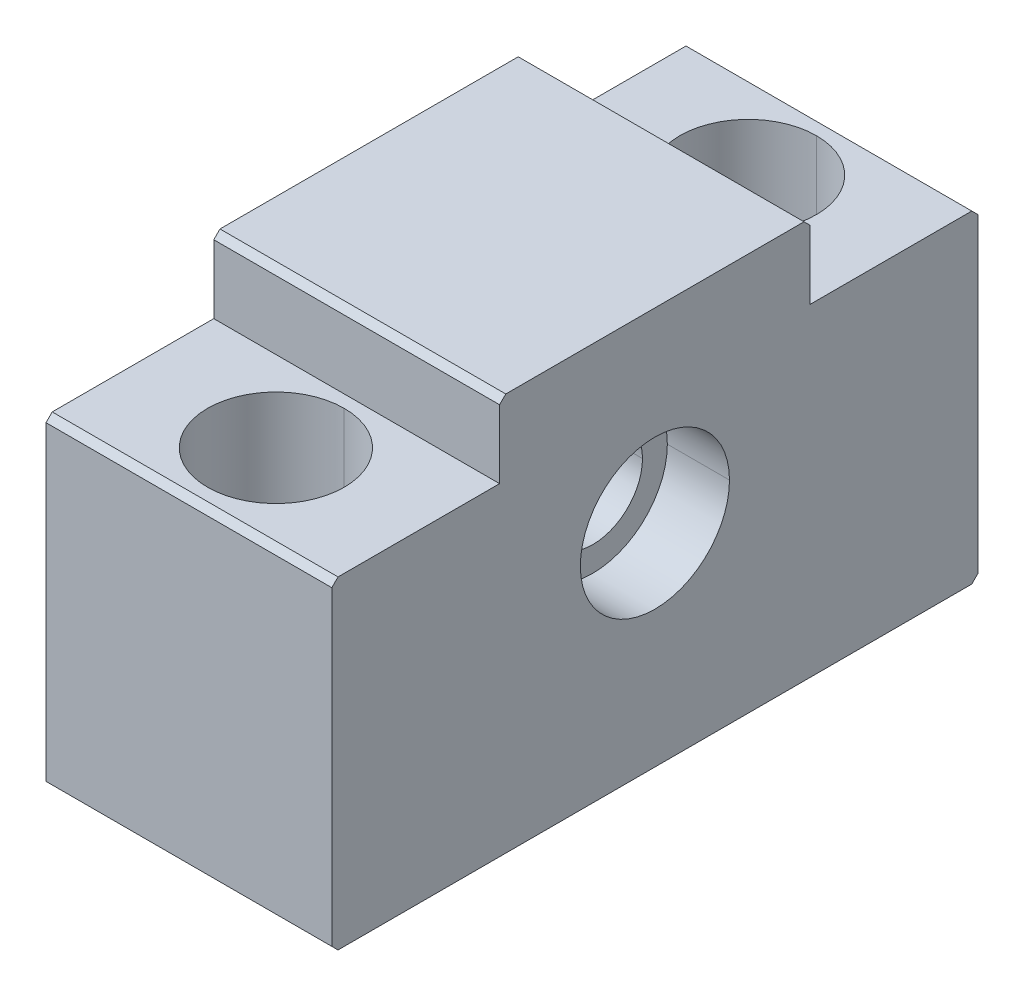
ISO-10303-21;
HEADER;
FILE_DESCRIPTION(('STEP AP214'),'2;1');
FILE_NAME('part.step','',(''),(''),'','','');
FILE_SCHEMA(('AUTOMOTIVE_DESIGN { 1 0 10303 214 1 1 1 1 }'));
ENDSEC;
DATA;
#1=APPLICATION_CONTEXT('core data for automotive mechanical design processes');
#2=APPLICATION_PROTOCOL_DEFINITION('international standard','automotive_design',2000,#1);
#3=PRODUCT_CONTEXT('',#1,'mechanical');
#4=PRODUCT('Part','Part','',(#3));
#5=PRODUCT_RELATED_PRODUCT_CATEGORY('part','',(#4));
#6=PRODUCT_DEFINITION_FORMATION('','',#4);
#7=PRODUCT_DEFINITION_CONTEXT('part definition',#1,'design');
#8=PRODUCT_DEFINITION('design','',#6,#7);
#9=PRODUCT_DEFINITION_SHAPE('','',#8);
#10=(LENGTH_UNIT() NAMED_UNIT(*) SI_UNIT(.MILLI.,.METRE.));
#11=(NAMED_UNIT(*) PLANE_ANGLE_UNIT() SI_UNIT($,.RADIAN.));
#12=(NAMED_UNIT(*) SI_UNIT($,.STERADIAN.) SOLID_ANGLE_UNIT());
#13=UNCERTAINTY_MEASURE_WITH_UNIT(LENGTH_MEASURE(1.E-05),#10,'distance_accuracy_value','');
#14=(GEOMETRIC_REPRESENTATION_CONTEXT(3) GLOBAL_UNCERTAINTY_ASSIGNED_CONTEXT((#13)) GLOBAL_UNIT_ASSIGNED_CONTEXT((#10,
#11,#12)) REPRESENTATION_CONTEXT('',''));
#15=CARTESIAN_POINT('',(0.,0.,0.));
#16=DIRECTION('',(0.,0.,1.));
#17=DIRECTION('',(1.,0.,0.));
#18=AXIS2_PLACEMENT_3D('',#15,#16,#17);
#19=CARTESIAN_POINT('',(11.5,26.,25.5));
#20=DIRECTION('',(0.,-0.707106781186548,-0.707106781186548));
#21=DIRECTION('',(0.,0.707106781186548,-0.707106781186548));
#22=AXIS2_PLACEMENT_3D('',#19,#20,#21);
#23=PLANE('',#22);
#24=DIRECTION('',(0.,-0.707106781186548,0.707106781186548));
#25=VECTOR('',#24,1.);
#26=CARTESIAN_POINT('',(-11.5,26.,25.5));
#27=LINE('',#26,#25);
#28=CARTESIAN_POINT('',(-11.5,26.,25.5));
#29=VERTEX_POINT('',#28);
#30=CARTESIAN_POINT('',(-11.5,25.5,26.));
#31=VERTEX_POINT('',#30);
#32=EDGE_CURVE('E11',#29,#31,#27,.T.);
#33=ORIENTED_EDGE('',*,*,#32,.T.);
#34=DIRECTION('',(-1.,0.,0.));
#35=VECTOR('',#34,1.);
#36=CARTESIAN_POINT('',(11.5,25.5,26.));
#37=LINE('',#36,#35);
#38=CARTESIAN_POINT('',(11.5,25.5,26.));
#39=VERTEX_POINT('',#38);
#40=EDGE_CURVE('E25',#39,#31,#37,.T.);
#41=ORIENTED_EDGE('',*,*,#40,.F.);
#42=DIRECTION('',(0.,-0.707106781186548,0.707106781186548));
#43=VECTOR('',#42,1.);
#44=CARTESIAN_POINT('',(11.5,26.,25.5));
#45=LINE('',#44,#43);
#46=CARTESIAN_POINT('',(11.5,26.,25.5));
#47=VERTEX_POINT('',#46);
#48=EDGE_CURVE('E631',#47,#39,#45,.T.);
#49=ORIENTED_EDGE('',*,*,#48,.F.);
#50=DIRECTION('',(-1.,0.,0.));
#51=VECTOR('',#50,1.);
#52=CARTESIAN_POINT('',(11.5,26.,25.5));
#53=LINE('',#52,#51);
#54=EDGE_CURVE('E627',#47,#29,#53,.T.);
#55=ORIENTED_EDGE('',*,*,#54,.T.);
#56=EDGE_LOOP('',(#33,#41,#49,#55));
#57=FACE_BOUND('',#56,.T.);
#58=ADVANCED_FACE('F17',(#57),#23,.F.);
#59=CARTESIAN_POINT('',(11.5,26.,12.5));
#60=DIRECTION('',(0.,-1.,0.));
#61=DIRECTION('',(0.,0.,-1.));
#62=AXIS2_PLACEMENT_3D('',#59,#60,#61);
#63=PLANE('',#62);
#64=CARTESIAN_POINT('',(0.,26.,19.));
#65=DIRECTION('',(0.,1.,0.));
#66=DIRECTION('',(0.,0.,1.));
#67=AXIS2_PLACEMENT_3D('',#64,#65,#66);
#68=CIRCLE('',#67,5.5);
#69=CARTESIAN_POINT('',(0.,26.,13.5));
#70=VERTEX_POINT('',#69);
#71=CARTESIAN_POINT('',(0.,26.,24.5));
#72=VERTEX_POINT('',#71);
#73=EDGE_CURVE('E229',#70,#72,#68,.T.);
#74=ORIENTED_EDGE('',*,*,#73,.F.);
#75=CARTESIAN_POINT('',(0.,26.,19.));
#76=DIRECTION('',(0.,1.,0.));
#77=DIRECTION('',(0.,0.,1.));
#78=AXIS2_PLACEMENT_3D('',#75,#76,#77);
#79=CIRCLE('',#78,5.5);
#80=EDGE_CURVE('E620',#72,#70,#79,.T.);
#81=ORIENTED_EDGE('',*,*,#80,.F.);
#82=EDGE_LOOP('',(#74,#81));
#83=FACE_BOUND('',#82,.T.);
#84=DIRECTION('',(0.,0.,1.));
#85=VECTOR('',#84,1.);
#86=CARTESIAN_POINT('',(-11.5,26.,12.5));
#87=LINE('',#86,#85);
#88=CARTESIAN_POINT('',(-11.5,26.,12.5));
#89=VERTEX_POINT('',#88);
#90=EDGE_CURVE('E615',#89,#29,#87,.T.);
#91=ORIENTED_EDGE('',*,*,#90,.T.);
#92=ORIENTED_EDGE('',*,*,#54,.F.);
#93=DIRECTION('',(0.,0.,1.));
#94=VECTOR('',#93,1.);
#95=CARTESIAN_POINT('',(11.5,26.,12.5));
#96=LINE('',#95,#94);
#97=CARTESIAN_POINT('',(11.5,26.,12.5));
#98=VERTEX_POINT('',#97);
#99=EDGE_CURVE('E610',#98,#47,#96,.T.);
#100=ORIENTED_EDGE('',*,*,#99,.F.);
#101=DIRECTION('',(-1.,0.,0.));
#102=VECTOR('',#101,1.);
#103=CARTESIAN_POINT('',(11.5,26.,12.5));
#104=LINE('',#103,#102);
#105=EDGE_CURVE('E606',#98,#89,#104,.T.);
#106=ORIENTED_EDGE('',*,*,#105,.T.);
#107=EDGE_LOOP('',(#91,#92,#100,#106));
#108=FACE_BOUND('',#107,.T.);
#109=ADVANCED_FACE('F649',(#83,#108),#63,.F.);
#110=CARTESIAN_POINT('',(11.5,31.5,12.5));
#111=DIRECTION('',(0.,0.,-1.));
#112=DIRECTION('',(-1.,0.,0.));
#113=AXIS2_PLACEMENT_3D('',#110,#111,#112);
#114=PLANE('',#113);
#115=DIRECTION('',(0.,-1.,0.));
#116=VECTOR('',#115,1.);
#117=CARTESIAN_POINT('',(-11.5,31.5,12.5));
#118=LINE('',#117,#116);
#119=CARTESIAN_POINT('',(-11.5,31.5,12.5));
#120=VERTEX_POINT('',#119);
#121=EDGE_CURVE('E601',#120,#89,#118,.T.);
#122=ORIENTED_EDGE('',*,*,#121,.T.);
#123=ORIENTED_EDGE('',*,*,#105,.F.);
#124=DIRECTION('',(0.,-1.,0.));
#125=VECTOR('',#124,1.);
#126=CARTESIAN_POINT('',(11.5,31.5,12.5));
#127=LINE('',#126,#125);
#128=CARTESIAN_POINT('',(11.5,31.5,12.5));
#129=VERTEX_POINT('',#128);
#130=EDGE_CURVE('E596',#129,#98,#127,.T.);
#131=ORIENTED_EDGE('',*,*,#130,.F.);
#132=DIRECTION('',(-1.,0.,0.));
#133=VECTOR('',#132,1.);
#134=CARTESIAN_POINT('',(11.5,31.5,12.5));
#135=LINE('',#134,#133);
#136=EDGE_CURVE('E592',#129,#120,#135,.T.);
#137=ORIENTED_EDGE('',*,*,#136,.T.);
#138=EDGE_LOOP('',(#122,#123,#131,#137));
#139=FACE_BOUND('',#138,.T.);
#140=ADVANCED_FACE('F694',(#139),#114,.F.);
#141=CARTESIAN_POINT('',(11.5,32.,12.));
#142=DIRECTION('',(0.,-0.707106781186548,-0.707106781186548));
#143=DIRECTION('',(0.,0.707106781186548,-0.707106781186548));
#144=AXIS2_PLACEMENT_3D('',#141,#142,#143);
#145=PLANE('',#144);
#146=DIRECTION('',(0.,-0.707106781186548,0.707106781186548));
#147=VECTOR('',#146,1.);
#148=CARTESIAN_POINT('',(-11.5,32.,12.));
#149=LINE('',#148,#147);
#150=CARTESIAN_POINT('',(-11.5,32.,12.));
#151=VERTEX_POINT('',#150);
#152=EDGE_CURVE('E587',#151,#120,#149,.T.);
#153=ORIENTED_EDGE('',*,*,#152,.T.);
#154=ORIENTED_EDGE('',*,*,#136,.F.);
#155=DIRECTION('',(0.,-0.707106781186548,0.707106781186548));
#156=VECTOR('',#155,1.);
#157=CARTESIAN_POINT('',(11.5,32.,12.));
#158=LINE('',#157,#156);
#159=CARTESIAN_POINT('',(11.5,32.,12.));
#160=VERTEX_POINT('',#159);
#161=EDGE_CURVE('E582',#160,#129,#158,.T.);
#162=ORIENTED_EDGE('',*,*,#161,.F.);
#163=DIRECTION('',(-1.,0.,0.));
#164=VECTOR('',#163,1.);
#165=CARTESIAN_POINT('',(11.5,32.,12.));
#166=LINE('',#165,#164);
#167=EDGE_CURVE('E578',#160,#151,#166,.T.);
#168=ORIENTED_EDGE('',*,*,#167,.T.);
#169=EDGE_LOOP('',(#153,#154,#162,#168));
#170=FACE_BOUND('',#169,.T.);
#171=ADVANCED_FACE('F691',(#170),#145,.F.);
#172=CARTESIAN_POINT('',(11.5,32.,-12.));
#173=DIRECTION('',(0.,-1.,0.));
#174=DIRECTION('',(0.,0.,-1.));
#175=AXIS2_PLACEMENT_3D('',#172,#173,#174);
#176=PLANE('',#175);
#177=DIRECTION('',(0.,0.,1.));
#178=VECTOR('',#177,1.);
#179=CARTESIAN_POINT('',(-11.5,32.,-12.));
#180=LINE('',#179,#178);
#181=CARTESIAN_POINT('',(-11.5,32.,-12.));
#182=VERTEX_POINT('',#181);
#183=EDGE_CURVE('E573',#182,#151,#180,.T.);
#184=ORIENTED_EDGE('',*,*,#183,.T.);
#185=ORIENTED_EDGE('',*,*,#167,.F.);
#186=DIRECTION('',(0.,0.,1.));
#187=VECTOR('',#186,1.);
#188=CARTESIAN_POINT('',(11.5,32.,-12.));
#189=LINE('',#188,#187);
#190=CARTESIAN_POINT('',(11.5,32.,-12.));
#191=VERTEX_POINT('',#190);
#192=EDGE_CURVE('E568',#191,#160,#189,.T.);
#193=ORIENTED_EDGE('',*,*,#192,.F.);
#194=DIRECTION('',(-1.,0.,0.));
#195=VECTOR('',#194,1.);
#196=CARTESIAN_POINT('',(11.5,32.,-12.));
#197=LINE('',#196,#195);
#198=EDGE_CURVE('E564',#191,#182,#197,.T.);
#199=ORIENTED_EDGE('',*,*,#198,.T.);
#200=EDGE_LOOP('',(#184,#185,#193,#199));
#201=FACE_BOUND('',#200,.T.);
#202=ADVANCED_FACE('F688',(#201),#176,.F.);
#203=CARTESIAN_POINT('',(11.5,31.5,-12.5));
#204=DIRECTION('',(0.,-0.707106781186548,0.707106781186548));
#205=DIRECTION('',(0.,-0.707106781186548,-0.707106781186548));
#206=AXIS2_PLACEMENT_3D('',#203,#204,#205);
#207=PLANE('',#206);
#208=DIRECTION('',(0.,0.707106781186548,0.707106781186548));
#209=VECTOR('',#208,1.);
#210=CARTESIAN_POINT('',(-11.5,31.5,-12.5));
#211=LINE('',#210,#209);
#212=CARTESIAN_POINT('',(-11.5,31.5,-12.5));
#213=VERTEX_POINT('',#212);
#214=EDGE_CURVE('E559',#213,#182,#211,.T.);
#215=ORIENTED_EDGE('',*,*,#214,.T.);
#216=ORIENTED_EDGE('',*,*,#198,.F.);
#217=DIRECTION('',(0.,0.707106781186548,0.707106781186548));
#218=VECTOR('',#217,1.);
#219=CARTESIAN_POINT('',(11.5,31.5,-12.5));
#220=LINE('',#219,#218);
#221=CARTESIAN_POINT('',(11.5,31.5,-12.5));
#222=VERTEX_POINT('',#221);
#223=EDGE_CURVE('E554',#222,#191,#220,.T.);
#224=ORIENTED_EDGE('',*,*,#223,.F.);
#225=DIRECTION('',(-1.,0.,0.));
#226=VECTOR('',#225,1.);
#227=CARTESIAN_POINT('',(11.5,31.5,-12.5));
#228=LINE('',#227,#226);
#229=EDGE_CURVE('E550',#222,#213,#228,.T.);
#230=ORIENTED_EDGE('',*,*,#229,.T.);
#231=EDGE_LOOP('',(#215,#216,#224,#230));
#232=FACE_BOUND('',#231,.T.);
#233=ADVANCED_FACE('F685',(#232),#207,.F.);
#234=CARTESIAN_POINT('',(11.5,26.,-12.5));
#235=DIRECTION('',(0.,0.,1.));
#236=DIRECTION('',(1.,0.,0.));
#237=AXIS2_PLACEMENT_3D('',#234,#235,#236);
#238=PLANE('',#237);
#239=DIRECTION('',(0.,1.,0.));
#240=VECTOR('',#239,1.);
#241=CARTESIAN_POINT('',(-11.5,26.,-12.5));
#242=LINE('',#241,#240);
#243=CARTESIAN_POINT('',(-11.5,26.,-12.5));
#244=VERTEX_POINT('',#243);
#245=EDGE_CURVE('E545',#244,#213,#242,.T.);
#246=ORIENTED_EDGE('',*,*,#245,.T.);
#247=ORIENTED_EDGE('',*,*,#229,.F.);
#248=DIRECTION('',(0.,1.,0.));
#249=VECTOR('',#248,1.);
#250=CARTESIAN_POINT('',(11.5,26.,-12.5));
#251=LINE('',#250,#249);
#252=CARTESIAN_POINT('',(11.5,26.,-12.5));
#253=VERTEX_POINT('',#252);
#254=EDGE_CURVE('E540',#253,#222,#251,.T.);
#255=ORIENTED_EDGE('',*,*,#254,.F.);
#256=DIRECTION('',(-1.,0.,0.));
#257=VECTOR('',#256,1.);
#258=CARTESIAN_POINT('',(11.5,26.,-12.5));
#259=LINE('',#258,#257);
#260=EDGE_CURVE('E536',#253,#244,#259,.T.);
#261=ORIENTED_EDGE('',*,*,#260,.T.);
#262=EDGE_LOOP('',(#246,#247,#255,#261));
#263=FACE_BOUND('',#262,.T.);
#264=ADVANCED_FACE('F679',(#263),#238,.F.);
#265=CARTESIAN_POINT('',(11.5,26.,-25.5));
#266=DIRECTION('',(0.,-1.,0.));
#267=DIRECTION('',(0.,0.,-1.));
#268=AXIS2_PLACEMENT_3D('',#265,#266,#267);
#269=PLANE('',#268);
#270=CARTESIAN_POINT('',(0.,26.,-19.));
#271=DIRECTION('',(0.,-1.,0.));
#272=DIRECTION('',(0.,0.,-1.));
#273=AXIS2_PLACEMENT_3D('',#270,#271,#272);
#274=CIRCLE('',#273,5.5);
#275=CARTESIAN_POINT('',(0.,26.,-24.5));
#276=VERTEX_POINT('',#275);
#277=CARTESIAN_POINT('',(0.,26.,-13.5));
#278=VERTEX_POINT('',#277);
#279=EDGE_CURVE('E532',#276,#278,#274,.T.);
#280=ORIENTED_EDGE('',*,*,#279,.T.);
#281=CARTESIAN_POINT('',(0.,26.,-19.));
#282=DIRECTION('',(0.,-1.,0.));
#283=DIRECTION('',(0.,0.,-1.));
#284=AXIS2_PLACEMENT_3D('',#281,#282,#283);
#285=CIRCLE('',#284,5.5);
#286=EDGE_CURVE('E528',#278,#276,#285,.T.);
#287=ORIENTED_EDGE('',*,*,#286,.T.);
#288=EDGE_LOOP('',(#280,#287));
#289=FACE_BOUND('',#288,.T.);
#290=DIRECTION('',(0.,0.,1.));
#291=VECTOR('',#290,1.);
#292=CARTESIAN_POINT('',(-11.5,26.,-25.5));
#293=LINE('',#292,#291);
#294=CARTESIAN_POINT('',(-11.5,26.,-25.5));
#295=VERTEX_POINT('',#294);
#296=EDGE_CURVE('E523',#295,#244,#293,.T.);
#297=ORIENTED_EDGE('',*,*,#296,.T.);
#298=ORIENTED_EDGE('',*,*,#260,.F.);
#299=DIRECTION('',(0.,0.,1.));
#300=VECTOR('',#299,1.);
#301=CARTESIAN_POINT('',(11.5,26.,-25.5));
#302=LINE('',#301,#300);
#303=CARTESIAN_POINT('',(11.5,26.,-25.5));
#304=VERTEX_POINT('',#303);
#305=EDGE_CURVE('E518',#304,#253,#302,.T.);
#306=ORIENTED_EDGE('',*,*,#305,.F.);
#307=DIRECTION('',(-1.,0.,0.));
#308=VECTOR('',#307,1.);
#309=CARTESIAN_POINT('',(11.5,26.,-25.5));
#310=LINE('',#309,#308);
#311=EDGE_CURVE('E514',#304,#295,#310,.T.);
#312=ORIENTED_EDGE('',*,*,#311,.T.);
#313=EDGE_LOOP('',(#297,#298,#306,#312));
#314=FACE_BOUND('',#313,.T.);
#315=ADVANCED_FACE('F675',(#289,#314),#269,.F.);
#316=CARTESIAN_POINT('',(11.5,25.5,-26.));
#317=DIRECTION('',(0.,-0.707106781186548,0.707106781186548));
#318=DIRECTION('',(0.,-0.707106781186548,-0.707106781186548));
#319=AXIS2_PLACEMENT_3D('',#316,#317,#318);
#320=PLANE('',#319);
#321=DIRECTION('',(0.,0.707106781186548,0.707106781186548));
#322=VECTOR('',#321,1.);
#323=CARTESIAN_POINT('',(-11.5,25.5,-26.));
#324=LINE('',#323,#322);
#325=CARTESIAN_POINT('',(-11.5,25.5,-26.));
#326=VERTEX_POINT('',#325);
#327=EDGE_CURVE('E509',#326,#295,#324,.T.);
#328=ORIENTED_EDGE('',*,*,#327,.T.);
#329=ORIENTED_EDGE('',*,*,#311,.F.);
#330=DIRECTION('',(0.,0.707106781186548,0.707106781186548));
#331=VECTOR('',#330,1.);
#332=CARTESIAN_POINT('',(11.5,25.5,-26.));
#333=LINE('',#332,#331);
#334=CARTESIAN_POINT('',(11.5,25.5,-26.));
#335=VERTEX_POINT('',#334);
#336=EDGE_CURVE('E504',#335,#304,#333,.T.);
#337=ORIENTED_EDGE('',*,*,#336,.F.);
#338=DIRECTION('',(-1.,0.,0.));
#339=VECTOR('',#338,1.);
#340=CARTESIAN_POINT('',(11.5,25.5,-26.));
#341=LINE('',#340,#339);
#342=EDGE_CURVE('E500',#335,#326,#341,.T.);
#343=ORIENTED_EDGE('',*,*,#342,.T.);
#344=EDGE_LOOP('',(#328,#329,#337,#343));
#345=FACE_BOUND('',#344,.T.);
#346=ADVANCED_FACE('F672',(#345),#320,.F.);
#347=CARTESIAN_POINT('',(11.5,0.5,-26.));
#348=DIRECTION('',(0.,0.,1.));
#349=DIRECTION('',(1.,0.,0.));
#350=AXIS2_PLACEMENT_3D('',#347,#348,#349);
#351=PLANE('',#350);
#352=DIRECTION('',(0.,1.,0.));
#353=VECTOR('',#352,1.);
#354=CARTESIAN_POINT('',(-11.5,0.5,-26.));
#355=LINE('',#354,#353);
#356=CARTESIAN_POINT('',(-11.5,0.5,-26.));
#357=VERTEX_POINT('',#356);
#358=EDGE_CURVE('E495',#357,#326,#355,.T.);
#359=ORIENTED_EDGE('',*,*,#358,.T.);
#360=ORIENTED_EDGE('',*,*,#342,.F.);
#361=DIRECTION('',(0.,1.,0.));
#362=VECTOR('',#361,1.);
#363=CARTESIAN_POINT('',(11.5,0.5,-26.));
#364=LINE('',#363,#362);
#365=CARTESIAN_POINT('',(11.5,0.5,-26.));
#366=VERTEX_POINT('',#365);
#367=EDGE_CURVE('E490',#366,#335,#364,.T.);
#368=ORIENTED_EDGE('',*,*,#367,.F.);
#369=DIRECTION('',(-1.,0.,0.));
#370=VECTOR('',#369,1.);
#371=CARTESIAN_POINT('',(11.5,0.5,-26.));
#372=LINE('',#371,#370);
#373=EDGE_CURVE('E486',#366,#357,#372,.T.);
#374=ORIENTED_EDGE('',*,*,#373,.T.);
#375=EDGE_LOOP('',(#359,#360,#368,#374));
#376=FACE_BOUND('',#375,.T.);
#377=ADVANCED_FACE('F667',(#376),#351,.F.);
#378=CARTESIAN_POINT('',(11.5,0.,-25.5));
#379=DIRECTION('',(0.,0.707106781186548,0.707106781186547));
#380=DIRECTION('',(0.,-0.707106781186547,0.707106781186548));
#381=AXIS2_PLACEMENT_3D('',#378,#379,#380);
#382=PLANE('',#381);
#383=DIRECTION('',(0.,0.707106781186547,-0.707106781186548));
#384=VECTOR('',#383,1.);
#385=CARTESIAN_POINT('',(-11.5,0.,-25.5));
#386=LINE('',#385,#384);
#387=CARTESIAN_POINT('',(-11.5,0.,-25.5));
#388=VERTEX_POINT('',#387);
#389=EDGE_CURVE('E481',#388,#357,#386,.T.);
#390=ORIENTED_EDGE('',*,*,#389,.T.);
#391=ORIENTED_EDGE('',*,*,#373,.F.);
#392=DIRECTION('',(0.,0.707106781186547,-0.707106781186548));
#393=VECTOR('',#392,1.);
#394=CARTESIAN_POINT('',(11.5,0.,-25.5));
#395=LINE('',#394,#393);
#396=CARTESIAN_POINT('',(11.5,0.,-25.5));
#397=VERTEX_POINT('',#396);
#398=EDGE_CURVE('E476',#397,#366,#395,.T.);
#399=ORIENTED_EDGE('',*,*,#398,.F.);
#400=DIRECTION('',(-1.,0.,0.));
#401=VECTOR('',#400,1.);
#402=CARTESIAN_POINT('',(11.5,0.,-25.5));
#403=LINE('',#402,#401);
#404=EDGE_CURVE('E472',#397,#388,#403,.T.);
#405=ORIENTED_EDGE('',*,*,#404,.T.);
#406=EDGE_LOOP('',(#390,#391,#399,#405));
#407=FACE_BOUND('',#406,.T.);
#408=ADVANCED_FACE('F664',(#407),#382,.F.);
#409=CARTESIAN_POINT('',(11.5,0.,25.5));
#410=DIRECTION('',(0.,1.,0.));
#411=DIRECTION('',(0.,0.,1.));
#412=AXIS2_PLACEMENT_3D('',#409,#410,#411);
#413=PLANE('',#412);
#414=CARTESIAN_POINT('',(0.,0.,19.));
#415=DIRECTION('',(0.,1.,0.));
#416=DIRECTION('',(0.,0.,1.));
#417=AXIS2_PLACEMENT_3D('',#414,#415,#416);
#418=CIRCLE('',#417,3.3);
#419=CARTESIAN_POINT('',(0.,0.,22.3));
#420=VERTEX_POINT('',#419);
#421=CARTESIAN_POINT('',(0.,0.,15.7));
#422=VERTEX_POINT('',#421);
#423=EDGE_CURVE('E468',#420,#422,#418,.T.);
#424=ORIENTED_EDGE('',*,*,#423,.T.);
#425=CARTESIAN_POINT('',(0.,0.,19.));
#426=DIRECTION('',(0.,1.,0.));
#427=DIRECTION('',(0.,0.,1.));
#428=AXIS2_PLACEMENT_3D('',#425,#426,#427);
#429=CIRCLE('',#428,3.3);
#430=EDGE_CURVE('E464',#422,#420,#429,.T.);
#431=ORIENTED_EDGE('',*,*,#430,.T.);
#432=EDGE_LOOP('',(#424,#431));
#433=FACE_BOUND('',#432,.T.);
#434=CARTESIAN_POINT('',(0.,0.,-19.));
#435=DIRECTION('',(0.,-1.,0.));
#436=DIRECTION('',(0.,0.,-1.));
#437=AXIS2_PLACEMENT_3D('',#434,#435,#436);
#438=CIRCLE('',#437,3.3);
#439=CARTESIAN_POINT('',(0.,0.,-15.7));
#440=VERTEX_POINT('',#439);
#441=CARTESIAN_POINT('',(0.,0.,-22.3));
#442=VERTEX_POINT('',#441);
#443=EDGE_CURVE('E459',#440,#442,#438,.T.);
#444=ORIENTED_EDGE('',*,*,#443,.F.);
#445=CARTESIAN_POINT('',(0.,0.,-19.));
#446=DIRECTION('',(0.,-1.,0.));
#447=DIRECTION('',(0.,0.,-1.));
#448=AXIS2_PLACEMENT_3D('',#445,#446,#447);
#449=CIRCLE('',#448,3.3);
#450=EDGE_CURVE('E454',#442,#440,#449,.T.);
#451=ORIENTED_EDGE('',*,*,#450,.F.);
#452=EDGE_LOOP('',(#444,#451));
#453=FACE_BOUND('',#452,.T.);
#454=DIRECTION('',(0.,0.,-1.));
#455=VECTOR('',#454,1.);
#456=CARTESIAN_POINT('',(-11.5,0.,25.5));
#457=LINE('',#456,#455);
#458=CARTESIAN_POINT('',(-11.5,0.,25.5));
#459=VERTEX_POINT('',#458);
#460=EDGE_CURVE('E449',#459,#388,#457,.T.);
#461=ORIENTED_EDGE('',*,*,#460,.T.);
#462=ORIENTED_EDGE('',*,*,#404,.F.);
#463=DIRECTION('',(0.,0.,-1.));
#464=VECTOR('',#463,1.);
#465=CARTESIAN_POINT('',(11.5,0.,25.5));
#466=LINE('',#465,#464);
#467=CARTESIAN_POINT('',(11.5,0.,25.5));
#468=VERTEX_POINT('',#467);
#469=EDGE_CURVE('E444',#468,#397,#466,.T.);
#470=ORIENTED_EDGE('',*,*,#469,.F.);
#471=DIRECTION('',(-1.,0.,0.));
#472=VECTOR('',#471,1.);
#473=CARTESIAN_POINT('',(11.5,0.,25.5));
#474=LINE('',#473,#472);
#475=EDGE_CURVE('E440',#468,#459,#474,.T.);
#476=ORIENTED_EDGE('',*,*,#475,.T.);
#477=EDGE_LOOP('',(#461,#462,#470,#476));
#478=FACE_BOUND('',#477,.T.);
#479=ADVANCED_FACE('F662',(#433,#453,#478),#413,.F.);
#480=CARTESIAN_POINT('',(11.5,0.5,26.));
#481=DIRECTION('',(0.,0.707106781186548,-0.707106781186547));
#482=DIRECTION('',(0.,0.707106781186547,0.707106781186548));
#483=AXIS2_PLACEMENT_3D('',#480,#481,#482);
#484=PLANE('',#483);
#485=DIRECTION('',(0.,-0.707106781186547,-0.707106781186548));
#486=VECTOR('',#485,1.);
#487=CARTESIAN_POINT('',(-11.5,0.5,26.));
#488=LINE('',#487,#486);
#489=CARTESIAN_POINT('',(-11.5,0.5,26.));
#490=VERTEX_POINT('',#489);
#491=EDGE_CURVE('E435',#490,#459,#488,.T.);
#492=ORIENTED_EDGE('',*,*,#491,.T.);
#493=ORIENTED_EDGE('',*,*,#475,.F.);
#494=DIRECTION('',(0.,-0.707106781186547,-0.707106781186548));
#495=VECTOR('',#494,1.);
#496=CARTESIAN_POINT('',(11.5,0.5,26.));
#497=LINE('',#496,#495);
#498=CARTESIAN_POINT('',(11.5,0.5,26.));
#499=VERTEX_POINT('',#498);
#500=EDGE_CURVE('E430',#499,#468,#497,.T.);
#501=ORIENTED_EDGE('',*,*,#500,.F.);
#502=DIRECTION('',(-1.,0.,0.));
#503=VECTOR('',#502,1.);
#504=CARTESIAN_POINT('',(11.5,0.5,26.));
#505=LINE('',#504,#503);
#506=EDGE_CURVE('E426',#499,#490,#505,.T.);
#507=ORIENTED_EDGE('',*,*,#506,.T.);
#508=EDGE_LOOP('',(#492,#493,#501,#507));
#509=FACE_BOUND('',#508,.T.);
#510=ADVANCED_FACE('F658',(#509),#484,.F.);
#511=CARTESIAN_POINT('',(11.5,25.5,26.));
#512=DIRECTION('',(0.,0.,-1.));
#513=DIRECTION('',(-1.,0.,0.));
#514=AXIS2_PLACEMENT_3D('',#511,#512,#513);
#515=PLANE('',#514);
#516=DIRECTION('',(0.,-1.,0.));
#517=VECTOR('',#516,1.);
#518=CARTESIAN_POINT('',(-11.5,25.5,26.));
#519=LINE('',#518,#517);
#520=EDGE_CURVE('E421',#31,#490,#519,.T.);
#521=ORIENTED_EDGE('',*,*,#520,.T.);
#522=ORIENTED_EDGE('',*,*,#506,.F.);
#523=DIRECTION('',(0.,-1.,0.));
#524=VECTOR('',#523,1.);
#525=CARTESIAN_POINT('',(11.5,25.5,26.));
#526=LINE('',#525,#524);
#527=EDGE_CURVE('E416',#39,#499,#526,.T.);
#528=ORIENTED_EDGE('',*,*,#527,.F.);
#529=ORIENTED_EDGE('',*,*,#40,.T.);
#530=EDGE_LOOP('',(#521,#522,#528,#529));
#531=FACE_BOUND('',#530,.T.);
#532=ADVANCED_FACE('F641',(#531),#515,.F.);
#533=CARTESIAN_POINT('',(11.5,0.,0.));
#534=DIRECTION('',(1.,0.,0.));
#535=DIRECTION('',(0.,0.,-1.));
#536=AXIS2_PLACEMENT_3D('',#533,#534,#535);
#537=PLANE('',#536);
#538=CARTESIAN_POINT('',(11.5,17.,0.));
#539=DIRECTION('',(1.,0.,0.));
#540=DIRECTION('',(0.,0.,-1.));
#541=AXIS2_PLACEMENT_3D('',#538,#539,#540);
#542=CIRCLE('',#541,6.);
#543=CARTESIAN_POINT('',(11.5,17.,6.));
#544=VERTEX_POINT('',#543);
#545=CARTESIAN_POINT('',(11.5,17.,-6.));
#546=VERTEX_POINT('',#545);
#547=EDGE_CURVE('E411',#544,#546,#542,.T.);
#548=ORIENTED_EDGE('',*,*,#547,.F.);
#549=CARTESIAN_POINT('',(11.5,17.,0.));
#550=DIRECTION('',(1.,0.,0.));
#551=DIRECTION('',(0.,0.,-1.));
#552=AXIS2_PLACEMENT_3D('',#549,#550,#551);
#553=CIRCLE('',#552,6.);
#554=EDGE_CURVE('E406',#546,#544,#553,.T.);
#555=ORIENTED_EDGE('',*,*,#554,.F.);
#556=EDGE_LOOP('',(#548,#555));
#557=FACE_BOUND('',#556,.T.);
#558=ORIENTED_EDGE('',*,*,#48,.T.);
#559=ORIENTED_EDGE('',*,*,#527,.T.);
#560=ORIENTED_EDGE('',*,*,#500,.T.);
#561=ORIENTED_EDGE('',*,*,#469,.T.);
#562=ORIENTED_EDGE('',*,*,#398,.T.);
#563=ORIENTED_EDGE('',*,*,#367,.T.);
#564=ORIENTED_EDGE('',*,*,#336,.T.);
#565=ORIENTED_EDGE('',*,*,#305,.T.);
#566=ORIENTED_EDGE('',*,*,#254,.T.);
#567=ORIENTED_EDGE('',*,*,#223,.T.);
#568=ORIENTED_EDGE('',*,*,#192,.T.);
#569=ORIENTED_EDGE('',*,*,#161,.T.);
#570=ORIENTED_EDGE('',*,*,#130,.T.);
#571=ORIENTED_EDGE('',*,*,#99,.T.);
#572=EDGE_LOOP('',(#558,#559,#560,#561,#562,#563,#564,#565,#566,#567,#568,#569,#570,#571));
#573=FACE_BOUND('',#572,.T.);
#574=ADVANCED_FACE('F645',(#557,#573),#537,.T.);
#575=CARTESIAN_POINT('',(11.5,17.,0.));
#576=DIRECTION('',(1.,0.,0.));
#577=DIRECTION('',(0.,-1.,0.));
#578=AXIS2_PLACEMENT_3D('',#575,#576,#577);
#579=CYLINDRICAL_SURFACE('',#578,6.);
#580=DIRECTION('',(1.,0.,0.));
#581=VECTOR('',#580,1.);
#582=CARTESIAN_POINT('',(6.5,17.,6.));
#583=LINE('',#582,#581);
#584=CARTESIAN_POINT('',(6.5,17.,6.));
#585=VERTEX_POINT('',#584);
#586=EDGE_CURVE('E401',#585,#544,#583,.T.);
#587=ORIENTED_EDGE('',*,*,#586,.F.);
#588=CARTESIAN_POINT('',(6.5,17.,0.));
#589=DIRECTION('',(1.,0.,0.));
#590=DIRECTION('',(0.,0.,-1.));
#591=AXIS2_PLACEMENT_3D('',#588,#589,#590);
#592=CIRCLE('',#591,6.);
#593=CARTESIAN_POINT('',(6.5,17.,-6.));
#594=VERTEX_POINT('',#593);
#595=EDGE_CURVE('E396',#594,#585,#592,.T.);
#596=ORIENTED_EDGE('',*,*,#595,.F.);
#597=DIRECTION('',(1.,0.,0.));
#598=VECTOR('',#597,1.);
#599=CARTESIAN_POINT('',(6.5,17.,-6.));
#600=LINE('',#599,#598);
#601=EDGE_CURVE('E391',#594,#546,#600,.T.);
#602=ORIENTED_EDGE('',*,*,#601,.T.);
#603=ORIENTED_EDGE('',*,*,#554,.T.);
#604=EDGE_LOOP('',(#587,#596,#602,#603));
#605=FACE_BOUND('',#604,.T.);
#606=ADVANCED_FACE('F830',(#605),#579,.F.);
#607=CARTESIAN_POINT('',(11.5,17.,0.));
#608=DIRECTION('',(1.,0.,0.));
#609=DIRECTION('',(0.,1.,0.));
#610=AXIS2_PLACEMENT_3D('',#607,#608,#609);
#611=CYLINDRICAL_SURFACE('',#610,6.);
#612=ORIENTED_EDGE('',*,*,#586,.T.);
#613=ORIENTED_EDGE('',*,*,#547,.T.);
#614=ORIENTED_EDGE('',*,*,#601,.F.);
#615=CARTESIAN_POINT('',(6.5,17.,0.));
#616=DIRECTION('',(1.,0.,0.));
#617=DIRECTION('',(0.,0.,-1.));
#618=AXIS2_PLACEMENT_3D('',#615,#616,#617);
#619=CIRCLE('',#618,6.);
#620=EDGE_CURVE('E386',#585,#594,#619,.T.);
#621=ORIENTED_EDGE('',*,*,#620,.F.);
#622=EDGE_LOOP('',(#612,#613,#614,#621));
#623=FACE_BOUND('',#622,.T.);
#624=ADVANCED_FACE('F841',(#623),#611,.F.);
#625=CARTESIAN_POINT('',(6.5,21.,0.));
#626=DIRECTION('',(1.,0.,0.));
#627=DIRECTION('',(0.,0.,-1.));
#628=AXIS2_PLACEMENT_3D('',#625,#626,#627);
#629=PLANE('',#628);
#630=ORIENTED_EDGE('',*,*,#595,.T.);
#631=ORIENTED_EDGE('',*,*,#620,.T.);
#632=EDGE_LOOP('',(#630,#631));
#633=FACE_BOUND('',#632,.T.);
#634=CARTESIAN_POINT('',(6.5,17.,0.));
#635=DIRECTION('',(1.,0.,0.));
#636=DIRECTION('',(0.,0.,-1.));
#637=AXIS2_PLACEMENT_3D('',#634,#635,#636);
#638=CIRCLE('',#637,4.);
#639=CARTESIAN_POINT('',(6.5,17.,4.));
#640=VERTEX_POINT('',#639);
#641=CARTESIAN_POINT('',(6.5,17.,-4.));
#642=VERTEX_POINT('',#641);
#643=EDGE_CURVE('E381',#640,#642,#638,.T.);
#644=ORIENTED_EDGE('',*,*,#643,.F.);
#645=CARTESIAN_POINT('',(6.5,17.,0.));
#646=DIRECTION('',(1.,0.,0.));
#647=DIRECTION('',(0.,0.,-1.));
#648=AXIS2_PLACEMENT_3D('',#645,#646,#647);
#649=CIRCLE('',#648,4.);
#650=EDGE_CURVE('E376',#642,#640,#649,.T.);
#651=ORIENTED_EDGE('',*,*,#650,.F.);
#652=EDGE_LOOP('',(#644,#651));
#653=FACE_BOUND('',#652,.T.);
#654=ADVANCED_FACE('F852',(#633,#653),#629,.T.);
#655=CARTESIAN_POINT('',(11.5,17.,0.));
#656=DIRECTION('',(1.,0.,0.));
#657=DIRECTION('',(0.,-1.,0.));
#658=AXIS2_PLACEMENT_3D('',#655,#656,#657);
#659=CYLINDRICAL_SURFACE('',#658,4.);
#660=DIRECTION('',(1.,0.,0.));
#661=VECTOR('',#660,1.);
#662=CARTESIAN_POINT('',(-7.5,17.,4.));
#663=LINE('',#662,#661);
#664=CARTESIAN_POINT('',(-7.5,17.,4.));
#665=VERTEX_POINT('',#664);
#666=EDGE_CURVE('E371',#665,#640,#663,.T.);
#667=ORIENTED_EDGE('',*,*,#666,.F.);
#668=CARTESIAN_POINT('',(-7.5,17.,0.));
#669=DIRECTION('',(1.,0.,0.));
#670=DIRECTION('',(0.,0.,-1.));
#671=AXIS2_PLACEMENT_3D('',#668,#669,#670);
#672=CIRCLE('',#671,4.);
#673=CARTESIAN_POINT('',(-7.5,17.,-4.));
#674=VERTEX_POINT('',#673);
#675=EDGE_CURVE('E366',#674,#665,#672,.T.);
#676=ORIENTED_EDGE('',*,*,#675,.F.);
#677=DIRECTION('',(1.,0.,0.));
#678=VECTOR('',#677,1.);
#679=CARTESIAN_POINT('',(-7.5,17.,-4.));
#680=LINE('',#679,#678);
#681=EDGE_CURVE('E361',#674,#642,#680,.T.);
#682=ORIENTED_EDGE('',*,*,#681,.T.);
#683=ORIENTED_EDGE('',*,*,#650,.T.);
#684=EDGE_LOOP('',(#667,#676,#682,#683));
#685=FACE_BOUND('',#684,.T.);
#686=ADVANCED_FACE('F863',(#685),#659,.F.);
#687=CARTESIAN_POINT('',(11.5,17.,0.));
#688=DIRECTION('',(1.,0.,0.));
#689=DIRECTION('',(0.,1.,0.));
#690=AXIS2_PLACEMENT_3D('',#687,#688,#689);
#691=CYLINDRICAL_SURFACE('',#690,4.);
#692=ORIENTED_EDGE('',*,*,#666,.T.);
#693=ORIENTED_EDGE('',*,*,#643,.T.);
#694=ORIENTED_EDGE('',*,*,#681,.F.);
#695=CARTESIAN_POINT('',(-7.5,17.,0.));
#696=DIRECTION('',(1.,0.,0.));
#697=DIRECTION('',(0.,0.,-1.));
#698=AXIS2_PLACEMENT_3D('',#695,#696,#697);
#699=CIRCLE('',#698,4.);
#700=EDGE_CURVE('E356',#665,#674,#699,.T.);
#701=ORIENTED_EDGE('',*,*,#700,.F.);
#702=EDGE_LOOP('',(#692,#693,#694,#701));
#703=FACE_BOUND('',#702,.T.);
#704=ADVANCED_FACE('F874',(#703),#691,.F.);
#705=CARTESIAN_POINT('',(-7.5,23.,0.));
#706=DIRECTION('',(-1.,0.,0.));
#707=DIRECTION('',(0.,0.,1.));
#708=AXIS2_PLACEMENT_3D('',#705,#706,#707);
#709=PLANE('',#708);
#710=ORIENTED_EDGE('',*,*,#675,.T.);
#711=ORIENTED_EDGE('',*,*,#700,.T.);
#712=EDGE_LOOP('',(#710,#711));
#713=FACE_BOUND('',#712,.T.);
#714=CARTESIAN_POINT('',(-7.5,17.,0.));
#715=DIRECTION('',(1.,0.,0.));
#716=DIRECTION('',(0.,0.,-1.));
#717=AXIS2_PLACEMENT_3D('',#714,#715,#716);
#718=CIRCLE('',#717,6.);
#719=CARTESIAN_POINT('',(-7.5,17.,6.));
#720=VERTEX_POINT('',#719);
#721=CARTESIAN_POINT('',(-7.5,17.,-6.));
#722=VERTEX_POINT('',#721);
#723=EDGE_CURVE('E351',#720,#722,#718,.T.);
#724=ORIENTED_EDGE('',*,*,#723,.F.);
#725=CARTESIAN_POINT('',(-7.5,17.,0.));
#726=DIRECTION('',(1.,0.,0.));
#727=DIRECTION('',(0.,0.,-1.));
#728=AXIS2_PLACEMENT_3D('',#725,#726,#727);
#729=CIRCLE('',#728,6.);
#730=EDGE_CURVE('E346',#722,#720,#729,.T.);
#731=ORIENTED_EDGE('',*,*,#730,.F.);
#732=EDGE_LOOP('',(#724,#731));
#733=FACE_BOUND('',#732,.T.);
#734=ADVANCED_FACE('F885',(#713,#733),#709,.T.);
#735=CARTESIAN_POINT('',(11.5,17.,0.));
#736=DIRECTION('',(1.,0.,0.));
#737=DIRECTION('',(0.,-1.,0.));
#738=AXIS2_PLACEMENT_3D('',#735,#736,#737);
#739=CYLINDRICAL_SURFACE('',#738,6.);
#740=DIRECTION('',(1.,0.,0.));
#741=VECTOR('',#740,1.);
#742=CARTESIAN_POINT('',(-10.5,17.,6.));
#743=LINE('',#742,#741);
#744=CARTESIAN_POINT('',(-10.5,17.,6.));
#745=VERTEX_POINT('',#744);
#746=EDGE_CURVE('E341',#745,#720,#743,.T.);
#747=ORIENTED_EDGE('',*,*,#746,.F.);
#748=CARTESIAN_POINT('',(-10.5,17.,0.));
#749=DIRECTION('',(1.,0.,0.));
#750=DIRECTION('',(0.,0.,-1.));
#751=AXIS2_PLACEMENT_3D('',#748,#749,#750);
#752=CIRCLE('',#751,6.);
#753=CARTESIAN_POINT('',(-10.5,17.,-6.));
#754=VERTEX_POINT('',#753);
#755=EDGE_CURVE('E336',#754,#745,#752,.T.);
#756=ORIENTED_EDGE('',*,*,#755,.F.);
#757=DIRECTION('',(1.,0.,0.));
#758=VECTOR('',#757,1.);
#759=CARTESIAN_POINT('',(-10.5,17.,-6.));
#760=LINE('',#759,#758);
#761=EDGE_CURVE('E331',#754,#722,#760,.T.);
#762=ORIENTED_EDGE('',*,*,#761,.T.);
#763=ORIENTED_EDGE('',*,*,#730,.T.);
#764=EDGE_LOOP('',(#747,#756,#762,#763));
#765=FACE_BOUND('',#764,.T.);
#766=ADVANCED_FACE('F896',(#765),#739,.F.);
#767=CARTESIAN_POINT('',(11.5,17.,0.));
#768=DIRECTION('',(1.,0.,0.));
#769=DIRECTION('',(0.,1.,0.));
#770=AXIS2_PLACEMENT_3D('',#767,#768,#769);
#771=CYLINDRICAL_SURFACE('',#770,6.);
#772=ORIENTED_EDGE('',*,*,#746,.T.);
#773=ORIENTED_EDGE('',*,*,#723,.T.);
#774=ORIENTED_EDGE('',*,*,#761,.F.);
#775=CARTESIAN_POINT('',(-10.5,17.,0.));
#776=DIRECTION('',(1.,0.,0.));
#777=DIRECTION('',(0.,0.,-1.));
#778=AXIS2_PLACEMENT_3D('',#775,#776,#777);
#779=CIRCLE('',#778,6.);
#780=EDGE_CURVE('E326',#745,#754,#779,.T.);
#781=ORIENTED_EDGE('',*,*,#780,.F.);
#782=EDGE_LOOP('',(#772,#773,#774,#781));
#783=FACE_BOUND('',#782,.T.);
#784=ADVANCED_FACE('F907',(#783),#771,.F.);
#785=CARTESIAN_POINT('',(-10.5,25.,0.));
#786=DIRECTION('',(-1.,0.,0.));
#787=DIRECTION('',(0.,0.,1.));
#788=AXIS2_PLACEMENT_3D('',#785,#786,#787);
#789=PLANE('',#788);
#790=ORIENTED_EDGE('',*,*,#755,.T.);
#791=ORIENTED_EDGE('',*,*,#780,.T.);
#792=EDGE_LOOP('',(#790,#791));
#793=FACE_BOUND('',#792,.T.);
#794=CARTESIAN_POINT('',(-10.5,17.,0.));
#795=DIRECTION('',(1.,0.,0.));
#796=DIRECTION('',(0.,0.,-1.));
#797=AXIS2_PLACEMENT_3D('',#794,#795,#796);
#798=CIRCLE('',#797,8.);
#799=CARTESIAN_POINT('',(-10.5,17.,8.));
#800=VERTEX_POINT('',#799);
#801=CARTESIAN_POINT('',(-10.5,17.,-8.));
#802=VERTEX_POINT('',#801);
#803=EDGE_CURVE('E321',#800,#802,#798,.T.);
#804=ORIENTED_EDGE('',*,*,#803,.F.);
#805=CARTESIAN_POINT('',(-10.5,17.,0.));
#806=DIRECTION('',(1.,0.,0.));
#807=DIRECTION('',(0.,0.,-1.));
#808=AXIS2_PLACEMENT_3D('',#805,#806,#807);
#809=CIRCLE('',#808,8.);
#810=EDGE_CURVE('E316',#802,#800,#809,.T.);
#811=ORIENTED_EDGE('',*,*,#810,.F.);
#812=EDGE_LOOP('',(#804,#811));
#813=FACE_BOUND('',#812,.T.);
#814=ADVANCED_FACE('F918',(#793,#813),#789,.T.);
#815=CARTESIAN_POINT('',(11.5,17.,0.));
#816=DIRECTION('',(1.,0.,0.));
#817=DIRECTION('',(0.,-1.,0.));
#818=AXIS2_PLACEMENT_3D('',#815,#816,#817);
#819=CYLINDRICAL_SURFACE('',#818,8.);
#820=DIRECTION('',(1.,0.,0.));
#821=VECTOR('',#820,1.);
#822=CARTESIAN_POINT('',(-11.5,17.,8.));
#823=LINE('',#822,#821);
#824=CARTESIAN_POINT('',(-11.5,17.,8.));
#825=VERTEX_POINT('',#824);
#826=EDGE_CURVE('E311',#825,#800,#823,.T.);
#827=ORIENTED_EDGE('',*,*,#826,.F.);
#828=CARTESIAN_POINT('',(-11.5,17.,0.));
#829=DIRECTION('',(1.,0.,0.));
#830=DIRECTION('',(0.,0.,-1.));
#831=AXIS2_PLACEMENT_3D('',#828,#829,#830);
#832=CIRCLE('',#831,8.);
#833=CARTESIAN_POINT('',(-11.5,17.,-8.));
#834=VERTEX_POINT('',#833);
#835=EDGE_CURVE('E306',#834,#825,#832,.T.);
#836=ORIENTED_EDGE('',*,*,#835,.F.);
#837=DIRECTION('',(1.,0.,0.));
#838=VECTOR('',#837,1.);
#839=CARTESIAN_POINT('',(-11.5,17.,-8.));
#840=LINE('',#839,#838);
#841=EDGE_CURVE('E301',#834,#802,#840,.T.);
#842=ORIENTED_EDGE('',*,*,#841,.T.);
#843=ORIENTED_EDGE('',*,*,#810,.T.);
#844=EDGE_LOOP('',(#827,#836,#842,#843));
#845=FACE_BOUND('',#844,.T.);
#846=ADVANCED_FACE('F929',(#845),#819,.F.);
#847=CARTESIAN_POINT('',(11.5,17.,0.));
#848=DIRECTION('',(1.,0.,0.));
#849=DIRECTION('',(0.,1.,0.));
#850=AXIS2_PLACEMENT_3D('',#847,#848,#849);
#851=CYLINDRICAL_SURFACE('',#850,8.);
#852=ORIENTED_EDGE('',*,*,#826,.T.);
#853=ORIENTED_EDGE('',*,*,#803,.T.);
#854=ORIENTED_EDGE('',*,*,#841,.F.);
#855=CARTESIAN_POINT('',(-11.5,17.,0.));
#856=DIRECTION('',(1.,0.,0.));
#857=DIRECTION('',(0.,0.,-1.));
#858=AXIS2_PLACEMENT_3D('',#855,#856,#857);
#859=CIRCLE('',#858,8.);
#860=EDGE_CURVE('E296',#825,#834,#859,.T.);
#861=ORIENTED_EDGE('',*,*,#860,.F.);
#862=EDGE_LOOP('',(#852,#853,#854,#861));
#863=FACE_BOUND('',#862,.T.);
#864=ADVANCED_FACE('F940',(#863),#851,.F.);
#865=CARTESIAN_POINT('',(-11.5,0.,0.));
#866=DIRECTION('',(1.,0.,0.));
#867=DIRECTION('',(0.,0.,-1.));
#868=AXIS2_PLACEMENT_3D('',#865,#866,#867);
#869=PLANE('',#868);
#870=ORIENTED_EDGE('',*,*,#835,.T.);
#871=ORIENTED_EDGE('',*,*,#860,.T.);
#872=EDGE_LOOP('',(#870,#871));
#873=FACE_BOUND('',#872,.T.);
#874=ORIENTED_EDGE('',*,*,#32,.F.);
#875=ORIENTED_EDGE('',*,*,#90,.F.);
#876=ORIENTED_EDGE('',*,*,#121,.F.);
#877=ORIENTED_EDGE('',*,*,#152,.F.);
#878=ORIENTED_EDGE('',*,*,#183,.F.);
#879=ORIENTED_EDGE('',*,*,#214,.F.);
#880=ORIENTED_EDGE('',*,*,#245,.F.);
#881=ORIENTED_EDGE('',*,*,#296,.F.);
#882=ORIENTED_EDGE('',*,*,#327,.F.);
#883=ORIENTED_EDGE('',*,*,#358,.F.);
#884=ORIENTED_EDGE('',*,*,#389,.F.);
#885=ORIENTED_EDGE('',*,*,#460,.F.);
#886=ORIENTED_EDGE('',*,*,#491,.F.);
#887=ORIENTED_EDGE('',*,*,#520,.F.);
#888=EDGE_LOOP('',(#874,#875,#876,#877,#878,#879,#880,#881,#882,#883,#884,#885,#886,#887));
#889=FACE_BOUND('',#888,.T.);
#890=ADVANCED_FACE('F653',(#873,#889),#869,.F.);
#891=CARTESIAN_POINT('',(0.,0.,-19.));
#892=DIRECTION('',(0.,-1.,0.));
#893=DIRECTION('',(-1.,0.,0.));
#894=AXIS2_PLACEMENT_3D('',#891,#892,#893);
#895=CYLINDRICAL_SURFACE('',#894,3.3);
#896=DIRECTION('',(0.,-1.,0.));
#897=VECTOR('',#896,1.);
#898=CARTESIAN_POINT('',(0.,15.,-15.7));
#899=LINE('',#898,#897);
#900=CARTESIAN_POINT('',(0.,15.,-15.7));
#901=VERTEX_POINT('',#900);
#902=EDGE_CURVE('E291',#901,#440,#899,.T.);
#903=ORIENTED_EDGE('',*,*,#902,.F.);
#904=CARTESIAN_POINT('',(0.,15.,-19.));
#905=DIRECTION('',(0.,-1.,0.));
#906=DIRECTION('',(0.,0.,-1.));
#907=AXIS2_PLACEMENT_3D('',#904,#905,#906);
#908=CIRCLE('',#907,3.3);
#909=CARTESIAN_POINT('',(0.,15.,-22.3));
#910=VERTEX_POINT('',#909);
#911=EDGE_CURVE('E286',#910,#901,#908,.T.);
#912=ORIENTED_EDGE('',*,*,#911,.F.);
#913=DIRECTION('',(0.,-1.,0.));
#914=VECTOR('',#913,1.);
#915=CARTESIAN_POINT('',(0.,15.,-22.3));
#916=LINE('',#915,#914);
#917=EDGE_CURVE('E281',#910,#442,#916,.T.);
#918=ORIENTED_EDGE('',*,*,#917,.T.);
#919=ORIENTED_EDGE('',*,*,#450,.T.);
#920=EDGE_LOOP('',(#903,#912,#918,#919));
#921=FACE_BOUND('',#920,.T.);
#922=ADVANCED_FACE('F961',(#921),#895,.F.);
#923=CARTESIAN_POINT('',(0.,0.,-19.));
#924=DIRECTION('',(0.,-1.,0.));
#925=DIRECTION('',(1.,0.,0.));
#926=AXIS2_PLACEMENT_3D('',#923,#924,#925);
#927=CYLINDRICAL_SURFACE('',#926,3.3);
#928=ORIENTED_EDGE('',*,*,#902,.T.);
#929=ORIENTED_EDGE('',*,*,#443,.T.);
#930=ORIENTED_EDGE('',*,*,#917,.F.);
#931=CARTESIAN_POINT('',(0.,15.,-19.));
#932=DIRECTION('',(0.,-1.,0.));
#933=DIRECTION('',(0.,0.,-1.));
#934=AXIS2_PLACEMENT_3D('',#931,#932,#933);
#935=CIRCLE('',#934,3.3);
#936=EDGE_CURVE('E276',#901,#910,#935,.T.);
#937=ORIENTED_EDGE('',*,*,#936,.F.);
#938=EDGE_LOOP('',(#928,#929,#930,#937));
#939=FACE_BOUND('',#938,.T.);
#940=ADVANCED_FACE('F972',(#939),#927,.F.);
#941=CARTESIAN_POINT('',(0.,15.,-24.5));
#942=DIRECTION('',(0.,1.,0.));
#943=DIRECTION('',(0.,0.,1.));
#944=AXIS2_PLACEMENT_3D('',#941,#942,#943);
#945=PLANE('',#944);
#946=ORIENTED_EDGE('',*,*,#911,.T.);
#947=ORIENTED_EDGE('',*,*,#936,.T.);
#948=EDGE_LOOP('',(#946,#947));
#949=FACE_BOUND('',#948,.T.);
#950=CARTESIAN_POINT('',(0.,15.,-19.));
#951=DIRECTION('',(0.,-1.,0.));
#952=DIRECTION('',(0.,0.,-1.));
#953=AXIS2_PLACEMENT_3D('',#950,#951,#952);
#954=CIRCLE('',#953,5.5);
#955=CARTESIAN_POINT('',(0.,15.,-13.5));
#956=VERTEX_POINT('',#955);
#957=CARTESIAN_POINT('',(0.,15.,-24.5));
#958=VERTEX_POINT('',#957);
#959=EDGE_CURVE('E271',#956,#958,#954,.T.);
#960=ORIENTED_EDGE('',*,*,#959,.F.);
#961=CARTESIAN_POINT('',(0.,15.,-19.));
#962=DIRECTION('',(0.,-1.,0.));
#963=DIRECTION('',(0.,0.,-1.));
#964=AXIS2_PLACEMENT_3D('',#961,#962,#963);
#965=CIRCLE('',#964,5.5);
#966=EDGE_CURVE('E266',#958,#956,#965,.T.);
#967=ORIENTED_EDGE('',*,*,#966,.F.);
#968=EDGE_LOOP('',(#960,#967));
#969=FACE_BOUND('',#968,.T.);
#970=ADVANCED_FACE('F983',(#949,#969),#945,.T.);
#971=CARTESIAN_POINT('',(0.,0.,-19.));
#972=DIRECTION('',(0.,-1.,0.));
#973=DIRECTION('',(-1.,0.,0.));
#974=AXIS2_PLACEMENT_3D('',#971,#972,#973);
#975=CYLINDRICAL_SURFACE('',#974,5.5);
#976=DIRECTION('',(0.,-1.,0.));
#977=VECTOR('',#976,1.);
#978=CARTESIAN_POINT('',(0.,26.,-13.5));
#979=LINE('',#978,#977);
#980=EDGE_CURVE('E261',#278,#956,#979,.T.);
#981=ORIENTED_EDGE('',*,*,#980,.F.);
#982=ORIENTED_EDGE('',*,*,#279,.F.);
#983=DIRECTION('',(0.,-1.,0.));
#984=VECTOR('',#983,1.);
#985=CARTESIAN_POINT('',(0.,26.,-24.5));
#986=LINE('',#985,#984);
#987=EDGE_CURVE('E256',#276,#958,#986,.T.);
#988=ORIENTED_EDGE('',*,*,#987,.T.);
#989=ORIENTED_EDGE('',*,*,#966,.T.);
#990=EDGE_LOOP('',(#981,#982,#988,#989));
#991=FACE_BOUND('',#990,.T.);
#992=ADVANCED_FACE('F994',(#991),#975,.F.);
#993=CARTESIAN_POINT('',(0.,0.,-19.));
#994=DIRECTION('',(0.,-1.,0.));
#995=DIRECTION('',(1.,0.,0.));
#996=AXIS2_PLACEMENT_3D('',#993,#994,#995);
#997=CYLINDRICAL_SURFACE('',#996,5.5);
#998=ORIENTED_EDGE('',*,*,#980,.T.);
#999=ORIENTED_EDGE('',*,*,#959,.T.);
#1000=ORIENTED_EDGE('',*,*,#987,.F.);
#1001=ORIENTED_EDGE('',*,*,#286,.F.);
#1002=EDGE_LOOP('',(#998,#999,#1000,#1001));
#1003=FACE_BOUND('',#1002,.T.);
#1004=ADVANCED_FACE('F1005',(#1003),#997,.F.);
#1005=CARTESIAN_POINT('',(0.,26.,19.));
#1006=DIRECTION('',(0.,1.,0.));
#1007=DIRECTION('',(1.,0.,0.));
#1008=AXIS2_PLACEMENT_3D('',#1005,#1006,#1007);
#1009=CYLINDRICAL_SURFACE('',#1008,3.3);
#1010=DIRECTION('',(0.,1.,0.));
#1011=VECTOR('',#1010,1.);
#1012=CARTESIAN_POINT('',(0.,0.,15.7));
#1013=LINE('',#1012,#1011);
#1014=CARTESIAN_POINT('',(0.,15.,15.7));
#1015=VERTEX_POINT('',#1014);
#1016=EDGE_CURVE('E252',#422,#1015,#1013,.T.);
#1017=ORIENTED_EDGE('',*,*,#1016,.T.);
#1018=CARTESIAN_POINT('',(0.,15.,19.));
#1019=DIRECTION('',(0.,1.,0.));
#1020=DIRECTION('',(0.,0.,1.));
#1021=AXIS2_PLACEMENT_3D('',#1018,#1019,#1020);
#1022=CIRCLE('',#1021,3.3);
#1023=CARTESIAN_POINT('',(0.,15.,22.3));
#1024=VERTEX_POINT('',#1023);
#1025=EDGE_CURVE('E248',#1015,#1024,#1022,.T.);
#1026=ORIENTED_EDGE('',*,*,#1025,.T.);
#1027=DIRECTION('',(0.,1.,0.));
#1028=VECTOR('',#1027,1.);
#1029=CARTESIAN_POINT('',(0.,0.,22.3));
#1030=LINE('',#1029,#1028);
#1031=EDGE_CURVE('E243',#420,#1024,#1030,.T.);
#1032=ORIENTED_EDGE('',*,*,#1031,.F.);
#1033=ORIENTED_EDGE('',*,*,#430,.F.);
#1034=EDGE_LOOP('',(#1017,#1026,#1032,#1033));
#1035=FACE_BOUND('',#1034,.T.);
#1036=ADVANCED_FACE('F1016',(#1035),#1009,.F.);
#1037=CARTESIAN_POINT('',(0.,26.,19.));
#1038=DIRECTION('',(0.,1.,0.));
#1039=DIRECTION('',(-1.,0.,0.));
#1040=AXIS2_PLACEMENT_3D('',#1037,#1038,#1039);
#1041=CYLINDRICAL_SURFACE('',#1040,3.3);
#1042=ORIENTED_EDGE('',*,*,#1016,.F.);
#1043=ORIENTED_EDGE('',*,*,#423,.F.);
#1044=ORIENTED_EDGE('',*,*,#1031,.T.);
#1045=CARTESIAN_POINT('',(0.,15.,19.));
#1046=DIRECTION('',(0.,1.,0.));
#1047=DIRECTION('',(0.,0.,1.));
#1048=AXIS2_PLACEMENT_3D('',#1045,#1046,#1047);
#1049=CIRCLE('',#1048,3.3);
#1050=EDGE_CURVE('E226',#1024,#1015,#1049,.T.);
#1051=ORIENTED_EDGE('',*,*,#1050,.T.);
#1052=EDGE_LOOP('',(#1042,#1043,#1044,#1051));
#1053=FACE_BOUND('',#1052,.T.);
#1054=ADVANCED_FACE('F1027',(#1053),#1041,.F.);
#1055=CARTESIAN_POINT('',(0.,15.,22.3));
#1056=DIRECTION('',(0.,1.,0.));
#1057=DIRECTION('',(0.,0.,1.));
#1058=AXIS2_PLACEMENT_3D('',#1055,#1056,#1057);
#1059=PLANE('',#1058);
#1060=CARTESIAN_POINT('',(0.,15.,19.));
#1061=DIRECTION('',(0.,1.,0.));
#1062=DIRECTION('',(0.,0.,1.));
#1063=AXIS2_PLACEMENT_3D('',#1060,#1061,#1062);
#1064=CIRCLE('',#1063,5.5);
#1065=CARTESIAN_POINT('',(0.,15.,24.5));
#1066=VERTEX_POINT('',#1065);
#1067=CARTESIAN_POINT('',(0.,15.,13.5));
#1068=VERTEX_POINT('',#1067);
#1069=EDGE_CURVE('E213',#1066,#1068,#1064,.T.);
#1070=ORIENTED_EDGE('',*,*,#1069,.T.);
#1071=CARTESIAN_POINT('',(0.,15.,19.));
#1072=DIRECTION('',(0.,1.,0.));
#1073=DIRECTION('',(0.,0.,1.));
#1074=AXIS2_PLACEMENT_3D('',#1071,#1072,#1073);
#1075=CIRCLE('',#1074,5.5);
#1076=EDGE_CURVE('E209',#1068,#1066,#1075,.T.);
#1077=ORIENTED_EDGE('',*,*,#1076,.T.);
#1078=EDGE_LOOP('',(#1070,#1077));
#1079=FACE_BOUND('',#1078,.T.);
#1080=ORIENTED_EDGE('',*,*,#1025,.F.);
#1081=ORIENTED_EDGE('',*,*,#1050,.F.);
#1082=EDGE_LOOP('',(#1080,#1081));
#1083=FACE_BOUND('',#1082,.T.);
#1084=ADVANCED_FACE('F211',(#1079,#1083),#1059,.T.);
#1085=CARTESIAN_POINT('',(0.,26.,19.));
#1086=DIRECTION('',(0.,1.,0.));
#1087=DIRECTION('',(1.,0.,0.));
#1088=AXIS2_PLACEMENT_3D('',#1085,#1086,#1087);
#1089=CYLINDRICAL_SURFACE('',#1088,5.5);
#1090=DIRECTION('',(0.,1.,0.));
#1091=VECTOR('',#1090,1.);
#1092=CARTESIAN_POINT('',(0.,15.,13.5));
#1093=LINE('',#1092,#1091);
#1094=EDGE_CURVE('E218',#1068,#70,#1093,.T.);
#1095=ORIENTED_EDGE('',*,*,#1094,.T.);
#1096=ORIENTED_EDGE('',*,*,#73,.T.);
#1097=DIRECTION('',(0.,1.,0.));
#1098=VECTOR('',#1097,1.);
#1099=CARTESIAN_POINT('',(0.,15.,24.5));
#1100=LINE('',#1099,#1098);
#1101=EDGE_CURVE('E224',#1066,#72,#1100,.T.);
#1102=ORIENTED_EDGE('',*,*,#1101,.F.);
#1103=ORIENTED_EDGE('',*,*,#1076,.F.);
#1104=EDGE_LOOP('',(#1095,#1096,#1102,#1103));
#1105=FACE_BOUND('',#1104,.T.);
#1106=ADVANCED_FACE('F228',(#1105),#1089,.F.);
#1107=CARTESIAN_POINT('',(0.,26.,19.));
#1108=DIRECTION('',(0.,1.,0.));
#1109=DIRECTION('',(-1.,0.,0.));
#1110=AXIS2_PLACEMENT_3D('',#1107,#1108,#1109);
#1111=CYLINDRICAL_SURFACE('',#1110,5.5);
#1112=ORIENTED_EDGE('',*,*,#1094,.F.);
#1113=ORIENTED_EDGE('',*,*,#1069,.F.);
#1114=ORIENTED_EDGE('',*,*,#1101,.T.);
#1115=ORIENTED_EDGE('',*,*,#80,.T.);
#1116=EDGE_LOOP('',(#1112,#1113,#1114,#1115));
#1117=FACE_BOUND('',#1116,.T.);
#1118=ADVANCED_FACE('F222',(#1117),#1111,.F.);
#1119=CLOSED_SHELL('',(#58,#109,#140,#171,#202,#233,#264,#315,#346,#377,#408,#479,#510,#532,
#574,#606,#624,#654,#686,#704,#734,#766,#784,#814,#846,#864,#890,#922,#940,#970,#992,#1004,
#1036,#1054,#1084,#1106,#1118));
#1120=MANIFOLD_SOLID_BREP('B1',#1119);
#1121=ADVANCED_BREP_SHAPE_REPRESENTATION('',(#18,#1120),#14);
#1122=SHAPE_DEFINITION_REPRESENTATION(#9,#1121);
ENDSEC;
END-ISO-10303-21;
